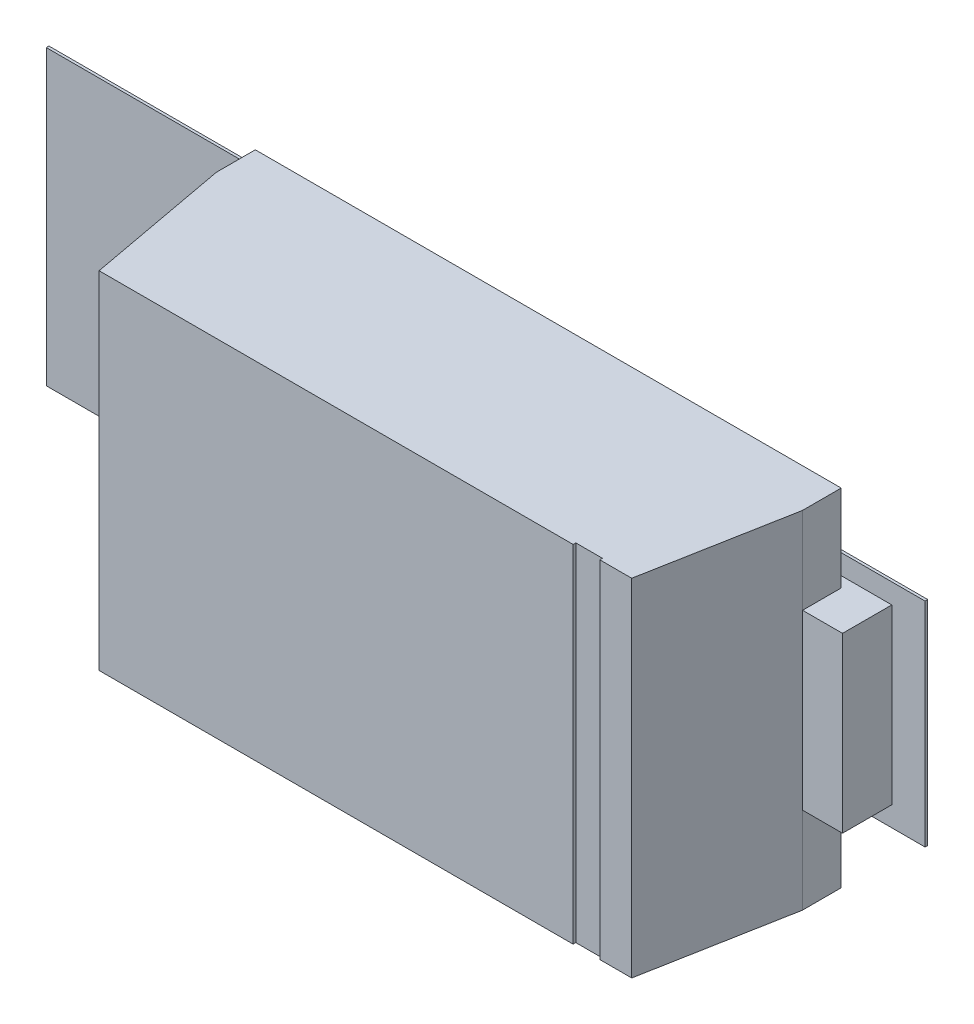
ISO-10303-21;
HEADER;
FILE_DESCRIPTION(('STEP AP214'),'2;1');
FILE_NAME('part.step','',(''),(''),'','','');
FILE_SCHEMA(('AUTOMOTIVE_DESIGN { 1 0 10303 214 1 1 1 1 }'));
ENDSEC;
DATA;
#1=APPLICATION_CONTEXT('core data for automotive mechanical design processes');
#2=APPLICATION_PROTOCOL_DEFINITION('international standard','automotive_design',2000,#1);
#3=PRODUCT_CONTEXT('',#1,'mechanical');
#4=PRODUCT('Part','Part','',(#3));
#5=PRODUCT_RELATED_PRODUCT_CATEGORY('part','',(#4));
#6=PRODUCT_DEFINITION_FORMATION('','',#4);
#7=PRODUCT_DEFINITION_CONTEXT('part definition',#1,'design');
#8=PRODUCT_DEFINITION('design','',#6,#7);
#9=PRODUCT_DEFINITION_SHAPE('','',#8);
#10=(LENGTH_UNIT() NAMED_UNIT(*) SI_UNIT(.MILLI.,.METRE.));
#11=(NAMED_UNIT(*) PLANE_ANGLE_UNIT() SI_UNIT($,.RADIAN.));
#12=(NAMED_UNIT(*) SI_UNIT($,.STERADIAN.) SOLID_ANGLE_UNIT());
#13=UNCERTAINTY_MEASURE_WITH_UNIT(LENGTH_MEASURE(1.E-05),#10,'distance_accuracy_value','');
#14=(GEOMETRIC_REPRESENTATION_CONTEXT(3) GLOBAL_UNCERTAINTY_ASSIGNED_CONTEXT((#13)) GLOBAL_UNIT_ASSIGNED_CONTEXT((#10,
#11,#12)) REPRESENTATION_CONTEXT('',''));
#15=CARTESIAN_POINT('',(0.,0.,0.));
#16=DIRECTION('',(0.,0.,1.));
#17=DIRECTION('',(1.,0.,0.));
#18=AXIS2_PLACEMENT_3D('',#15,#16,#17);
#19=CARTESIAN_POINT('',(-1.09999999999992,-0.64999999999994,0.272199999999978));
#20=DIRECTION('',(0.983318171348509,0.,-0.181893853375602));
#21=DIRECTION('',(0.,-1.,0.));
#22=AXIS2_PLACEMENT_3D('',#19,#20,#21);
#23=PLANE('',#22);
#24=DIRECTION('',(0.181893853375602,0.,0.983318171348509));
#25=VECTOR('',#24,1.);
#26=CARTESIAN_POINT('',(-1.09999999999992,0.64999999999994,0.272199999999978));
#27=LINE('',#26,#25);
#28=CARTESIAN_POINT('',(-1.09999999999992,0.64999999999994,0.272199999999978));
#29=VERTEX_POINT('',#28);
#30=CARTESIAN_POINT('',(-1.00000000000006,0.64999999999994,0.8128));
#31=VERTEX_POINT('',#30);
#32=EDGE_CURVE('E248',#29,#31,#27,.T.);
#33=ORIENTED_EDGE('',*,*,#32,.F.);
#34=DIRECTION('',(0.,-1.,0.));
#35=VECTOR('',#34,1.);
#36=CARTESIAN_POINT('',(-1.09999999999992,0.64999999999994,0.272199999999978));
#37=LINE('',#36,#35);
#38=CARTESIAN_POINT('',(-1.09999999999992,-0.64999999999994,0.272199999999978));
#39=VERTEX_POINT('',#38);
#40=EDGE_CURVE('E358',#29,#39,#37,.T.);
#41=ORIENTED_EDGE('',*,*,#40,.T.);
#42=DIRECTION('',(0.181893853375602,0.,0.983318171348509));
#43=VECTOR('',#42,1.);
#44=CARTESIAN_POINT('',(-1.09999999999992,-0.64999999999994,0.272199999999978));
#45=LINE('',#44,#43);
#46=CARTESIAN_POINT('',(-1.00000000000006,-0.64999999999994,0.8128));
#47=VERTEX_POINT('',#46);
#48=EDGE_CURVE('E290',#39,#47,#45,.T.);
#49=ORIENTED_EDGE('',*,*,#48,.T.);
#50=DIRECTION('',(0.,1.,0.));
#51=VECTOR('',#50,1.);
#52=CARTESIAN_POINT('',(-1.00000000000006,-0.64999999999994,0.8128));
#53=LINE('',#52,#51);
#54=EDGE_CURVE('E271',#47,#31,#53,.T.);
#55=ORIENTED_EDGE('',*,*,#54,.T.);
#56=EDGE_LOOP('',(#33,#41,#49,#55));
#57=FACE_BOUND('',#56,.T.);
#58=ADVANCED_FACE('F16',(#57),#23,.F.);
#59=CARTESIAN_POINT('',(1.25000000000008,-0.32499999999997,0.0762));
#60=DIRECTION('',(1.,0.,0.));
#61=DIRECTION('',(0.,1.,0.));
#62=AXIS2_PLACEMENT_3D('',#59,#60,#61);
#63=PLANE('',#62);
#64=DIRECTION('',(0.,1.,0.));
#65=VECTOR('',#64,1.);
#66=CARTESIAN_POINT('',(1.25000000000008,-0.32499999999997,0.0862000000000108));
#67=LINE('',#66,#65);
#68=CARTESIAN_POINT('',(1.25000000000008,-0.32499999999997,0.0862000000000108));
#69=VERTEX_POINT('',#68);
#70=CARTESIAN_POINT('',(1.25000000000008,0.32499999999997,0.0862000000000108));
#71=VERTEX_POINT('',#70);
#72=EDGE_CURVE('E313',#69,#71,#67,.T.);
#73=ORIENTED_EDGE('',*,*,#72,.T.);
#74=DIRECTION('',(0.,0.,1.));
#75=VECTOR('',#74,1.);
#76=CARTESIAN_POINT('',(1.25000000000008,0.32499999999997,0.0862000000000108));
#77=LINE('',#76,#75);
#78=CARTESIAN_POINT('',(1.25000000000008,0.32499999999997,0.271199999999982));
#79=VERTEX_POINT('',#78);
#80=EDGE_CURVE('E11',#71,#79,#77,.T.);
#81=ORIENTED_EDGE('',*,*,#80,.T.);
#82=DIRECTION('',(0.,1.,0.));
#83=VECTOR('',#82,1.);
#84=CARTESIAN_POINT('',(1.25000000000008,-0.32499999999997,0.271199999999982));
#85=LINE('',#84,#83);
#86=CARTESIAN_POINT('',(1.25000000000008,-0.32499999999997,0.271199999999982));
#87=VERTEX_POINT('',#86);
#88=EDGE_CURVE('E191',#87,#79,#85,.T.);
#89=ORIENTED_EDGE('',*,*,#88,.F.);
#90=DIRECTION('',(0.,0.,1.));
#91=VECTOR('',#90,1.);
#92=CARTESIAN_POINT('',(1.25000000000008,-0.32499999999997,0.0862000000000108));
#93=LINE('',#92,#91);
#94=EDGE_CURVE('E393',#69,#87,#93,.T.);
#95=ORIENTED_EDGE('',*,*,#94,.F.);
#96=EDGE_LOOP('',(#73,#81,#89,#95));
#97=FACE_BOUND('',#96,.T.);
#98=ADVANCED_FACE('F674',(#97),#63,.T.);
#99=CARTESIAN_POINT('',(1.25000000000008,0.32499999999997,0.0762));
#100=DIRECTION('',(0.,1.,0.));
#101=DIRECTION('',(1.,0.,0.));
#102=AXIS2_PLACEMENT_3D('',#99,#100,#101);
#103=PLANE('',#102);
#104=DIRECTION('',(-1.,0.,0.));
#105=VECTOR('',#104,1.);
#106=CARTESIAN_POINT('',(1.25000000000008,0.32499999999997,0.0862000000000108));
#107=LINE('',#106,#105);
#108=CARTESIAN_POINT('',(0.599999999999886,0.32499999999997,0.0862000000000108));
#109=VERTEX_POINT('',#108);
#110=EDGE_CURVE('E318',#71,#109,#107,.T.);
#111=ORIENTED_EDGE('',*,*,#110,.T.);
#112=DIRECTION('',(0.,0.,1.));
#113=VECTOR('',#112,1.);
#114=CARTESIAN_POINT('',(0.599999999999886,0.32499999999997,0.0862000000000108));
#115=LINE('',#114,#113);
#116=CARTESIAN_POINT('',(0.599999999999886,0.32499999999997,0.126200000000003));
#117=VERTEX_POINT('',#116);
#118=EDGE_CURVE('E27',#109,#117,#115,.T.);
#119=ORIENTED_EDGE('',*,*,#118,.T.);
#120=DIRECTION('',(-1.,0.,0.));
#121=VECTOR('',#120,1.);
#122=CARTESIAN_POINT('',(1.09999999999992,0.32499999999997,0.126200000000003));
#123=LINE('',#122,#121);
#124=CARTESIAN_POINT('',(1.09999999999992,0.32499999999997,0.126200000000003));
#125=VERTEX_POINT('',#124);
#126=EDGE_CURVE('E200',#125,#117,#123,.T.);
#127=ORIENTED_EDGE('',*,*,#126,.F.);
#128=DIRECTION('',(0.,0.,1.));
#129=VECTOR('',#128,1.);
#130=CARTESIAN_POINT('',(1.09999999999992,0.32499999999997,0.126200000000003));
#131=LINE('',#130,#129);
#132=CARTESIAN_POINT('',(1.09999999999992,0.32499999999997,0.271199999999982));
#133=VERTEX_POINT('',#132);
#134=EDGE_CURVE('E197',#125,#133,#131,.T.);
#135=ORIENTED_EDGE('',*,*,#134,.T.);
#136=DIRECTION('',(-1.,0.,0.));
#137=VECTOR('',#136,1.);
#138=CARTESIAN_POINT('',(1.25000000000008,0.32499999999997,0.271199999999982));
#139=LINE('',#138,#137);
#140=EDGE_CURVE('E183',#79,#133,#139,.T.);
#141=ORIENTED_EDGE('',*,*,#140,.F.);
#142=ORIENTED_EDGE('',*,*,#80,.F.);
#143=EDGE_LOOP('',(#111,#119,#127,#135,#141,#142));
#144=FACE_BOUND('',#143,.T.);
#145=ADVANCED_FACE('F198',(#144),#103,.T.);
#146=CARTESIAN_POINT('',(0.599999999999886,0.32499999999997,0.0762));
#147=DIRECTION('',(-1.,0.,0.));
#148=DIRECTION('',(0.,0.,1.));
#149=AXIS2_PLACEMENT_3D('',#146,#147,#148);
#150=PLANE('',#149);
#151=DIRECTION('',(0.,-1.,0.));
#152=VECTOR('',#151,1.);
#153=CARTESIAN_POINT('',(0.599999999999886,0.32499999999997,0.0862000000000108));
#154=LINE('',#153,#152);
#155=CARTESIAN_POINT('',(0.599999999999886,-0.32499999999997,0.0862000000000108));
#156=VERTEX_POINT('',#155);
#157=EDGE_CURVE('E229',#109,#156,#154,.T.);
#158=ORIENTED_EDGE('',*,*,#157,.T.);
#159=DIRECTION('',(0.,0.,1.));
#160=VECTOR('',#159,1.);
#161=CARTESIAN_POINT('',(0.599999999999886,-0.32499999999997,0.0862000000000108));
#162=LINE('',#161,#160);
#163=CARTESIAN_POINT('',(0.599999999999886,-0.32499999999997,0.126200000000003));
#164=VERTEX_POINT('',#163);
#165=EDGE_CURVE('E284',#156,#164,#162,.T.);
#166=ORIENTED_EDGE('',*,*,#165,.T.);
#167=DIRECTION('',(0.,-1.,0.));
#168=VECTOR('',#167,1.);
#169=CARTESIAN_POINT('',(0.599999999999886,0.32499999999997,0.126200000000003));
#170=LINE('',#169,#168);
#171=EDGE_CURVE('E283',#117,#164,#170,.T.);
#172=ORIENTED_EDGE('',*,*,#171,.F.);
#173=ORIENTED_EDGE('',*,*,#118,.F.);
#174=EDGE_LOOP('',(#158,#166,#172,#173));
#175=FACE_BOUND('',#174,.T.);
#176=ADVANCED_FACE('F686',(#175),#150,.T.);
#177=CARTESIAN_POINT('',(1.09999999999992,-0.64999999999994,0.126200000000003));
#178=DIRECTION('',(0.,0.,1.));
#179=DIRECTION('',(1.,0.,0.));
#180=AXIS2_PLACEMENT_3D('',#177,#178,#179);
#181=PLANE('',#180);
#182=DIRECTION('',(1.,0.,0.));
#183=VECTOR('',#182,1.);
#184=CARTESIAN_POINT('',(-1.09999999999992,-0.32499999999997,0.126200000000003));
#185=LINE('',#184,#183);
#186=CARTESIAN_POINT('',(-1.09999999999992,-0.32499999999997,0.126200000000003));
#187=VERTEX_POINT('',#186);
#188=CARTESIAN_POINT('',(0.0500000000000032,-0.32499999999997,0.126200000000003));
#189=VERTEX_POINT('',#188);
#190=EDGE_CURVE('E477',#187,#189,#185,.T.);
#191=ORIENTED_EDGE('',*,*,#190,.T.);
#192=DIRECTION('',(0.,1.,0.));
#193=VECTOR('',#192,1.);
#194=CARTESIAN_POINT('',(0.0500000000000032,-0.32499999999997,0.126200000000003));
#195=LINE('',#194,#193);
#196=CARTESIAN_POINT('',(0.0500000000000032,0.32499999999997,0.126200000000003));
#197=VERTEX_POINT('',#196);
#198=EDGE_CURVE('E354',#189,#197,#195,.T.);
#199=ORIENTED_EDGE('',*,*,#198,.T.);
#200=DIRECTION('',(1.,0.,0.));
#201=VECTOR('',#200,1.);
#202=CARTESIAN_POINT('',(-1.09999999999992,0.32499999999997,0.126200000000003));
#203=LINE('',#202,#201);
#204=CARTESIAN_POINT('',(-1.09999999999992,0.32499999999997,0.126200000000003));
#205=VERTEX_POINT('',#204);
#206=EDGE_CURVE('E221',#205,#197,#203,.T.);
#207=ORIENTED_EDGE('',*,*,#206,.F.);
#208=DIRECTION('',(0.,-1.,0.));
#209=VECTOR('',#208,1.);
#210=CARTESIAN_POINT('',(-1.09999999999992,0.64999999999994,0.126200000000003));
#211=LINE('',#210,#209);
#212=CARTESIAN_POINT('',(-1.09999999999992,0.64999999999994,0.126200000000003));
#213=VERTEX_POINT('',#212);
#214=EDGE_CURVE('E435',#213,#205,#211,.T.);
#215=ORIENTED_EDGE('',*,*,#214,.F.);
#216=DIRECTION('',(-1.,0.,0.));
#217=VECTOR('',#216,1.);
#218=CARTESIAN_POINT('',(1.09999999999992,0.64999999999994,0.126200000000003));
#219=LINE('',#218,#217);
#220=CARTESIAN_POINT('',(1.09999999999992,0.64999999999994,0.126200000000003));
#221=VERTEX_POINT('',#220);
#222=EDGE_CURVE('E322',#221,#213,#219,.T.);
#223=ORIENTED_EDGE('',*,*,#222,.F.);
#224=DIRECTION('',(0.,1.,0.));
#225=VECTOR('',#224,1.);
#226=CARTESIAN_POINT('',(1.09999999999992,0.32499999999997,0.126200000000003));
#227=LINE('',#226,#225);
#228=EDGE_CURVE('E205',#125,#221,#227,.T.);
#229=ORIENTED_EDGE('',*,*,#228,.F.);
#230=ORIENTED_EDGE('',*,*,#126,.T.);
#231=ORIENTED_EDGE('',*,*,#171,.T.);
#232=DIRECTION('',(-1.,0.,0.));
#233=VECTOR('',#232,1.);
#234=CARTESIAN_POINT('',(1.09999999999992,-0.32499999999997,0.126200000000003));
#235=LINE('',#234,#233);
#236=CARTESIAN_POINT('',(1.09999999999992,-0.32499999999997,0.126200000000003));
#237=VERTEX_POINT('',#236);
#238=EDGE_CURVE('E289',#237,#164,#235,.T.);
#239=ORIENTED_EDGE('',*,*,#238,.F.);
#240=DIRECTION('',(0.,1.,0.));
#241=VECTOR('',#240,1.);
#242=CARTESIAN_POINT('',(1.09999999999992,-0.64999999999994,0.126200000000003));
#243=LINE('',#242,#241);
#244=CARTESIAN_POINT('',(1.09999999999992,-0.64999999999994,0.126200000000003));
#245=VERTEX_POINT('',#244);
#246=EDGE_CURVE('E224',#245,#237,#243,.T.);
#247=ORIENTED_EDGE('',*,*,#246,.F.);
#248=DIRECTION('',(1.,0.,0.));
#249=VECTOR('',#248,1.);
#250=CARTESIAN_POINT('',(-1.09999999999992,-0.64999999999994,0.126200000000003));
#251=LINE('',#250,#249);
#252=CARTESIAN_POINT('',(-1.09999999999992,-0.64999999999994,0.126200000000003));
#253=VERTEX_POINT('',#252);
#254=EDGE_CURVE('E308',#253,#245,#251,.T.);
#255=ORIENTED_EDGE('',*,*,#254,.F.);
#256=DIRECTION('',(0.,-1.,0.));
#257=VECTOR('',#256,1.);
#258=CARTESIAN_POINT('',(-1.09999999999992,-0.32499999999997,0.126200000000003));
#259=LINE('',#258,#257);
#260=EDGE_CURVE('E194',#187,#253,#259,.T.);
#261=ORIENTED_EDGE('',*,*,#260,.F.);
#262=EDGE_LOOP('',(#191,#199,#207,#215,#223,#229,#230,#231,#239,#247,#255,#261));
#263=FACE_BOUND('',#262,.T.);
#264=ADVANCED_FACE('F501',(#263),#181,.F.);
#265=CARTESIAN_POINT('',(-1.09999999999992,0.64999999999994,0.0762));
#266=DIRECTION('',(-1.,0.,0.));
#267=DIRECTION('',(0.,0.,1.));
#268=AXIS2_PLACEMENT_3D('',#265,#266,#267);
#269=PLANE('',#268);
#270=DIRECTION('',(0.,0.,1.));
#271=VECTOR('',#270,1.);
#272=CARTESIAN_POINT('',(-1.09999999999992,-0.32499999999997,0.126200000000003));
#273=LINE('',#272,#271);
#274=CARTESIAN_POINT('',(-1.09999999999992,-0.32499999999997,0.271199999999982));
#275=VERTEX_POINT('',#274);
#276=EDGE_CURVE('E473',#187,#275,#273,.T.);
#277=ORIENTED_EDGE('',*,*,#276,.F.);
#278=ORIENTED_EDGE('',*,*,#260,.T.);
#279=DIRECTION('',(0.,0.,1.));
#280=VECTOR('',#279,1.);
#281=CARTESIAN_POINT('',(-1.09999999999992,-0.64999999999994,0.126200000000003));
#282=LINE('',#281,#280);
#283=EDGE_CURVE('E294',#253,#39,#282,.T.);
#284=ORIENTED_EDGE('',*,*,#283,.T.);
#285=ORIENTED_EDGE('',*,*,#40,.F.);
#286=DIRECTION('',(0.,0.,1.));
#287=VECTOR('',#286,1.);
#288=CARTESIAN_POINT('',(-1.09999999999992,0.64999999999994,0.126200000000003));
#289=LINE('',#288,#287);
#290=EDGE_CURVE('E274',#213,#29,#289,.T.);
#291=ORIENTED_EDGE('',*,*,#290,.F.);
#292=ORIENTED_EDGE('',*,*,#214,.T.);
#293=DIRECTION('',(0.,0.,1.));
#294=VECTOR('',#293,1.);
#295=CARTESIAN_POINT('',(-1.09999999999992,0.32499999999997,0.126200000000003));
#296=LINE('',#295,#294);
#297=CARTESIAN_POINT('',(-1.09999999999992,0.32499999999997,0.271199999999982));
#298=VERTEX_POINT('',#297);
#299=EDGE_CURVE('E427',#205,#298,#296,.T.);
#300=ORIENTED_EDGE('',*,*,#299,.T.);
#301=DIRECTION('',(0.,1.,0.));
#302=VECTOR('',#301,1.);
#303=CARTESIAN_POINT('',(-1.09999999999992,-0.32499999999997,0.271199999999982));
#304=LINE('',#303,#302);
#305=EDGE_CURVE('E481',#275,#298,#304,.T.);
#306=ORIENTED_EDGE('',*,*,#305,.F.);
#307=EDGE_LOOP('',(#277,#278,#284,#285,#291,#292,#300,#306));
#308=FACE_BOUND('',#307,.T.);
#309=ADVANCED_FACE('F491',(#308),#269,.T.);
#310=CARTESIAN_POINT('',(0.,0.,0.271199999999982));
#311=DIRECTION('',(0.,0.,1.));
#312=DIRECTION('',(1.,0.,0.));
#313=AXIS2_PLACEMENT_3D('',#310,#311,#312);
#314=PLANE('',#313);
#315=DIRECTION('',(1.,0.,0.));
#316=VECTOR('',#315,1.);
#317=CARTESIAN_POINT('',(1.09999999999992,-0.32499999999997,0.271199999999982));
#318=LINE('',#317,#316);
#319=CARTESIAN_POINT('',(1.09999999999992,-0.32499999999997,0.271199999999982));
#320=VERTEX_POINT('',#319);
#321=EDGE_CURVE('E387',#320,#87,#318,.T.);
#322=ORIENTED_EDGE('',*,*,#321,.T.);
#323=ORIENTED_EDGE('',*,*,#88,.T.);
#324=ORIENTED_EDGE('',*,*,#140,.T.);
#325=DIRECTION('',(0.,1.,0.));
#326=VECTOR('',#325,1.);
#327=CARTESIAN_POINT('',(1.09999999999992,-0.32499999999997,0.271199999999982));
#328=LINE('',#327,#326);
#329=EDGE_CURVE('E188',#320,#133,#328,.T.);
#330=ORIENTED_EDGE('',*,*,#329,.F.);
#331=EDGE_LOOP('',(#322,#323,#324,#330));
#332=FACE_BOUND('',#331,.T.);
#333=ADVANCED_FACE('F186',(#332),#314,.T.);
#334=CARTESIAN_POINT('',(0.,0.,0.271199999999982));
#335=DIRECTION('',(0.,0.,1.));
#336=DIRECTION('',(1.,0.,0.));
#337=AXIS2_PLACEMENT_3D('',#334,#335,#336);
#338=PLANE('',#337);
#339=DIRECTION('',(1.,0.,0.));
#340=VECTOR('',#339,1.);
#341=CARTESIAN_POINT('',(-1.25000000000008,-0.32499999999997,0.271199999999982));
#342=LINE('',#341,#340);
#343=CARTESIAN_POINT('',(-1.25000000000008,-0.32499999999997,0.271199999999982));
#344=VERTEX_POINT('',#343);
#345=EDGE_CURVE('E476',#344,#275,#342,.T.);
#346=ORIENTED_EDGE('',*,*,#345,.T.);
#347=ORIENTED_EDGE('',*,*,#305,.T.);
#348=DIRECTION('',(-1.,0.,0.));
#349=VECTOR('',#348,1.);
#350=CARTESIAN_POINT('',(-1.09999999999992,0.32499999999997,0.271199999999982));
#351=LINE('',#350,#349);
#352=CARTESIAN_POINT('',(-1.25000000000008,0.32499999999997,0.271199999999982));
#353=VERTEX_POINT('',#352);
#354=EDGE_CURVE('E346',#298,#353,#351,.T.);
#355=ORIENTED_EDGE('',*,*,#354,.T.);
#356=DIRECTION('',(0.,-1.,0.));
#357=VECTOR('',#356,1.);
#358=CARTESIAN_POINT('',(-1.25000000000008,0.32499999999997,0.271199999999982));
#359=LINE('',#358,#357);
#360=EDGE_CURVE('E337',#353,#344,#359,.T.);
#361=ORIENTED_EDGE('',*,*,#360,.T.);
#362=EDGE_LOOP('',(#346,#347,#355,#361));
#363=FACE_BOUND('',#362,.T.);
#364=ADVANCED_FACE('F719',(#363),#338,.T.);
#365=CARTESIAN_POINT('',(-1.25000000000008,-0.32499999999997,0.0762));
#366=DIRECTION('',(0.,-1.,0.));
#367=DIRECTION('',(0.,0.,-1.));
#368=AXIS2_PLACEMENT_3D('',#365,#366,#367);
#369=PLANE('',#368);
#370=DIRECTION('',(1.,0.,0.));
#371=VECTOR('',#370,1.);
#372=CARTESIAN_POINT('',(-1.25000000000008,-0.32499999999997,0.0862000000000108));
#373=LINE('',#372,#371);
#374=CARTESIAN_POINT('',(-1.25000000000008,-0.32499999999997,0.0862000000000108));
#375=VERTEX_POINT('',#374);
#376=CARTESIAN_POINT('',(0.0500000000000032,-0.32499999999997,0.0862000000000108));
#377=VERTEX_POINT('',#376);
#378=EDGE_CURVE('E267',#375,#377,#373,.T.);
#379=ORIENTED_EDGE('',*,*,#378,.T.);
#380=DIRECTION('',(0.,0.,1.));
#381=VECTOR('',#380,1.);
#382=CARTESIAN_POINT('',(0.0500000000000032,-0.32499999999997,0.0862000000000108));
#383=LINE('',#382,#381);
#384=EDGE_CURVE('E534',#377,#189,#383,.T.);
#385=ORIENTED_EDGE('',*,*,#384,.T.);
#386=ORIENTED_EDGE('',*,*,#190,.F.);
#387=ORIENTED_EDGE('',*,*,#276,.T.);
#388=ORIENTED_EDGE('',*,*,#345,.F.);
#389=DIRECTION('',(0.,0.,1.));
#390=VECTOR('',#389,1.);
#391=CARTESIAN_POINT('',(-1.25000000000008,-0.32499999999997,0.0862000000000108));
#392=LINE('',#391,#390);
#393=EDGE_CURVE('E342',#375,#344,#392,.T.);
#394=ORIENTED_EDGE('',*,*,#393,.F.);
#395=EDGE_LOOP('',(#379,#385,#386,#387,#388,#394));
#396=FACE_BOUND('',#395,.T.);
#397=ADVANCED_FACE('F715',(#396),#369,.T.);
#398=CARTESIAN_POINT('',(0.0500000000000032,-0.32499999999997,0.0762));
#399=DIRECTION('',(1.,0.,0.));
#400=DIRECTION('',(0.,1.,0.));
#401=AXIS2_PLACEMENT_3D('',#398,#399,#400);
#402=PLANE('',#401);
#403=DIRECTION('',(0.,1.,0.));
#404=VECTOR('',#403,1.);
#405=CARTESIAN_POINT('',(0.0500000000000032,-0.32499999999997,0.0862000000000108));
#406=LINE('',#405,#404);
#407=CARTESIAN_POINT('',(0.0500000000000032,0.32499999999997,0.0862000000000108));
#408=VERTEX_POINT('',#407);
#409=EDGE_CURVE('E398',#377,#408,#406,.T.);
#410=ORIENTED_EDGE('',*,*,#409,.T.);
#411=DIRECTION('',(0.,0.,1.));
#412=VECTOR('',#411,1.);
#413=CARTESIAN_POINT('',(0.0500000000000032,0.32499999999997,0.0862000000000108));
#414=LINE('',#413,#412);
#415=EDGE_CURVE('E350',#408,#197,#414,.T.);
#416=ORIENTED_EDGE('',*,*,#415,.T.);
#417=ORIENTED_EDGE('',*,*,#198,.F.);
#418=ORIENTED_EDGE('',*,*,#384,.F.);
#419=EDGE_LOOP('',(#410,#416,#417,#418));
#420=FACE_BOUND('',#419,.T.);
#421=ADVANCED_FACE('F718',(#420),#402,.T.);
#422=CARTESIAN_POINT('',(0.0500000000000032,0.32499999999997,0.0762));
#423=DIRECTION('',(0.,1.,0.));
#424=DIRECTION('',(1.,0.,0.));
#425=AXIS2_PLACEMENT_3D('',#422,#423,#424);
#426=PLANE('',#425);
#427=DIRECTION('',(-1.,0.,0.));
#428=VECTOR('',#427,1.);
#429=CARTESIAN_POINT('',(0.0500000000000032,0.32499999999997,0.0862000000000108));
#430=LINE('',#429,#428);
#431=CARTESIAN_POINT('',(-1.25000000000008,0.32499999999997,0.0862000000000108));
#432=VERTEX_POINT('',#431);
#433=EDGE_CURVE('E402',#408,#432,#430,.T.);
#434=ORIENTED_EDGE('',*,*,#433,.T.);
#435=DIRECTION('',(0.,0.,1.));
#436=VECTOR('',#435,1.);
#437=CARTESIAN_POINT('',(-1.25000000000008,0.32499999999997,0.0862000000000108));
#438=LINE('',#437,#436);
#439=EDGE_CURVE('E341',#432,#353,#438,.T.);
#440=ORIENTED_EDGE('',*,*,#439,.T.);
#441=ORIENTED_EDGE('',*,*,#354,.F.);
#442=ORIENTED_EDGE('',*,*,#299,.F.);
#443=ORIENTED_EDGE('',*,*,#206,.T.);
#444=ORIENTED_EDGE('',*,*,#415,.F.);
#445=EDGE_LOOP('',(#434,#440,#441,#442,#443,#444));
#446=FACE_BOUND('',#445,.T.);
#447=ADVANCED_FACE('F506',(#446),#426,.T.);
#448=CARTESIAN_POINT('',(-1.25000000000008,0.32499999999997,0.0762));
#449=DIRECTION('',(-1.,0.,0.));
#450=DIRECTION('',(0.,0.,1.));
#451=AXIS2_PLACEMENT_3D('',#448,#449,#450);
#452=PLANE('',#451);
#453=DIRECTION('',(0.,-1.,0.));
#454=VECTOR('',#453,1.);
#455=CARTESIAN_POINT('',(-1.25000000000008,0.32499999999997,0.0862000000000108));
#456=LINE('',#455,#454);
#457=EDGE_CURVE('E419',#432,#375,#456,.T.);
#458=ORIENTED_EDGE('',*,*,#457,.T.);
#459=ORIENTED_EDGE('',*,*,#393,.T.);
#460=ORIENTED_EDGE('',*,*,#360,.F.);
#461=ORIENTED_EDGE('',*,*,#439,.F.);
#462=EDGE_LOOP('',(#458,#459,#460,#461));
#463=FACE_BOUND('',#462,.T.);
#464=ADVANCED_FACE('F712',(#463),#452,.T.);
#465=CARTESIAN_POINT('',(1.37500000000009,0.399999999999924,0.0762));
#466=DIRECTION('',(0.,1.,0.));
#467=DIRECTION('',(1.,0.,0.));
#468=AXIS2_PLACEMENT_3D('',#465,#466,#467);
#469=PLANE('',#468);
#470=DIRECTION('',(-1.,0.,0.));
#471=VECTOR('',#470,1.);
#472=CARTESIAN_POINT('',(1.37500000000009,0.399999999999924,0.0762));
#473=LINE('',#472,#471);
#474=CARTESIAN_POINT('',(1.37500000000009,0.399999999999924,0.0762));
#475=VERTEX_POINT('',#474);
#476=CARTESIAN_POINT('',(0.574999999999986,0.399999999999924,0.0762));
#477=VERTEX_POINT('',#476);
#478=EDGE_CURVE('E376',#475,#477,#473,.T.);
#479=ORIENTED_EDGE('',*,*,#478,.T.);
#480=DIRECTION('',(0.,0.,1.));
#481=VECTOR('',#480,1.);
#482=CARTESIAN_POINT('',(0.574999999999986,0.399999999999924,0.0762));
#483=LINE('',#482,#481);
#484=CARTESIAN_POINT('',(0.574999999999986,0.399999999999924,0.0862000000000108));
#485=VERTEX_POINT('',#484);
#486=EDGE_CURVE('E236',#477,#485,#483,.T.);
#487=ORIENTED_EDGE('',*,*,#486,.T.);
#488=DIRECTION('',(-1.,0.,0.));
#489=VECTOR('',#488,1.);
#490=CARTESIAN_POINT('',(1.37500000000009,0.399999999999924,0.0862000000000108));
#491=LINE('',#490,#489);
#492=CARTESIAN_POINT('',(1.37500000000009,0.399999999999924,0.0862000000000108));
#493=VERTEX_POINT('',#492);
#494=EDGE_CURVE('E225',#493,#485,#491,.T.);
#495=ORIENTED_EDGE('',*,*,#494,.F.);
#496=DIRECTION('',(0.,0.,1.));
#497=VECTOR('',#496,1.);
#498=CARTESIAN_POINT('',(1.37500000000009,0.399999999999924,0.0762));
#499=LINE('',#498,#497);
#500=EDGE_CURVE('E333',#475,#493,#499,.T.);
#501=ORIENTED_EDGE('',*,*,#500,.F.);
#502=EDGE_LOOP('',(#479,#487,#495,#501));
#503=FACE_BOUND('',#502,.T.);
#504=ADVANCED_FACE('F566',(#503),#469,.T.);
#505=CARTESIAN_POINT('',(1.37500000000009,-0.399999999999924,0.0762));
#506=DIRECTION('',(1.,0.,0.));
#507=DIRECTION('',(0.,1.,0.));
#508=AXIS2_PLACEMENT_3D('',#505,#506,#507);
#509=PLANE('',#508);
#510=DIRECTION('',(0.,1.,0.));
#511=VECTOR('',#510,1.);
#512=CARTESIAN_POINT('',(1.37500000000009,-0.399999999999924,0.0762));
#513=LINE('',#512,#511);
#514=CARTESIAN_POINT('',(1.37500000000009,-0.399999999999924,0.0762));
#515=VERTEX_POINT('',#514);
#516=EDGE_CURVE('E379',#515,#475,#513,.T.);
#517=ORIENTED_EDGE('',*,*,#516,.T.);
#518=ORIENTED_EDGE('',*,*,#500,.T.);
#519=DIRECTION('',(0.,1.,0.));
#520=VECTOR('',#519,1.);
#521=CARTESIAN_POINT('',(1.37500000000009,-0.399999999999924,0.0862000000000108));
#522=LINE('',#521,#520);
#523=CARTESIAN_POINT('',(1.37500000000009,-0.399999999999924,0.0862000000000108));
#524=VERTEX_POINT('',#523);
#525=EDGE_CURVE('E230',#524,#493,#522,.T.);
#526=ORIENTED_EDGE('',*,*,#525,.F.);
#527=DIRECTION('',(0.,0.,1.));
#528=VECTOR('',#527,1.);
#529=CARTESIAN_POINT('',(1.37500000000009,-0.399999999999924,0.0762));
#530=LINE('',#529,#528);
#531=EDGE_CURVE('E298',#515,#524,#530,.T.);
#532=ORIENTED_EDGE('',*,*,#531,.F.);
#533=EDGE_LOOP('',(#517,#518,#526,#532));
#534=FACE_BOUND('',#533,.T.);
#535=ADVANCED_FACE('F711',(#534),#509,.T.);
#536=CARTESIAN_POINT('',(0.574999999999986,-0.399999999999924,0.0762));
#537=DIRECTION('',(0.,-1.,0.));
#538=DIRECTION('',(0.,0.,-1.));
#539=AXIS2_PLACEMENT_3D('',#536,#537,#538);
#540=PLANE('',#539);
#541=DIRECTION('',(1.,0.,0.));
#542=VECTOR('',#541,1.);
#543=CARTESIAN_POINT('',(0.574999999999986,-0.399999999999924,0.0762));
#544=LINE('',#543,#542);
#545=CARTESIAN_POINT('',(0.574999999999986,-0.399999999999924,0.0762));
#546=VERTEX_POINT('',#545);
#547=EDGE_CURVE('E348',#546,#515,#544,.T.);
#548=ORIENTED_EDGE('',*,*,#547,.T.);
#549=ORIENTED_EDGE('',*,*,#531,.T.);
#550=DIRECTION('',(1.,0.,0.));
#551=VECTOR('',#550,1.);
#552=CARTESIAN_POINT('',(0.574999999999986,-0.399999999999924,0.0862000000000108));
#553=LINE('',#552,#551);
#554=CARTESIAN_POINT('',(0.574999999999986,-0.399999999999924,0.0862000000000108));
#555=VERTEX_POINT('',#554);
#556=EDGE_CURVE('E359',#555,#524,#553,.T.);
#557=ORIENTED_EDGE('',*,*,#556,.F.);
#558=DIRECTION('',(0.,0.,1.));
#559=VECTOR('',#558,1.);
#560=CARTESIAN_POINT('',(0.574999999999986,-0.399999999999924,0.0762));
#561=LINE('',#560,#559);
#562=EDGE_CURVE('E266',#546,#555,#561,.T.);
#563=ORIENTED_EDGE('',*,*,#562,.F.);
#564=EDGE_LOOP('',(#548,#549,#557,#563));
#565=FACE_BOUND('',#564,.T.);
#566=ADVANCED_FACE('F562',(#565),#540,.T.);
#567=CARTESIAN_POINT('',(-1.92499999999992,0.550000000000086,0.0762));
#568=DIRECTION('',(-1.,0.,0.));
#569=DIRECTION('',(0.,0.,1.));
#570=AXIS2_PLACEMENT_3D('',#567,#568,#569);
#571=PLANE('',#570);
#572=DIRECTION('',(0.,-1.,0.));
#573=VECTOR('',#572,1.);
#574=CARTESIAN_POINT('',(-1.92499999999992,0.550000000000086,0.0762));
#575=LINE('',#574,#573);
#576=CARTESIAN_POINT('',(-1.92499999999992,0.550000000000086,0.0762));
#577=VERTEX_POINT('',#576);
#578=CARTESIAN_POINT('',(-1.92499999999992,-0.550000000000086,0.0762));
#579=VERTEX_POINT('',#578);
#580=EDGE_CURVE('E380',#577,#579,#575,.T.);
#581=ORIENTED_EDGE('',*,*,#580,.T.);
#582=DIRECTION('',(0.,0.,1.));
#583=VECTOR('',#582,1.);
#584=CARTESIAN_POINT('',(-1.92499999999992,-0.550000000000086,0.0762));
#585=LINE('',#584,#583);
#586=CARTESIAN_POINT('',(-1.92499999999992,-0.550000000000086,0.0862000000000108));
#587=VERTEX_POINT('',#586);
#588=EDGE_CURVE('E295',#579,#587,#585,.T.);
#589=ORIENTED_EDGE('',*,*,#588,.T.);
#590=DIRECTION('',(0.,-1.,0.));
#591=VECTOR('',#590,1.);
#592=CARTESIAN_POINT('',(-1.92499999999992,0.550000000000086,0.0862000000000108));
#593=LINE('',#592,#591);
#594=CARTESIAN_POINT('',(-1.92499999999992,0.550000000000086,0.0862000000000108));
#595=VERTEX_POINT('',#594);
#596=EDGE_CURVE('E397',#595,#587,#593,.T.);
#597=ORIENTED_EDGE('',*,*,#596,.F.);
#598=DIRECTION('',(0.,0.,1.));
#599=VECTOR('',#598,1.);
#600=CARTESIAN_POINT('',(-1.92499999999992,0.550000000000086,0.0762));
#601=LINE('',#600,#599);
#602=EDGE_CURVE('E330',#577,#595,#601,.T.);
#603=ORIENTED_EDGE('',*,*,#602,.F.);
#604=EDGE_LOOP('',(#581,#589,#597,#603));
#605=FACE_BOUND('',#604,.T.);
#606=ADVANCED_FACE('F646',(#605),#571,.T.);
#607=CARTESIAN_POINT('',(-1.92499999999992,-0.550000000000086,0.0762));
#608=DIRECTION('',(0.,-1.,0.));
#609=DIRECTION('',(0.,0.,-1.));
#610=AXIS2_PLACEMENT_3D('',#607,#608,#609);
#611=PLANE('',#610);
#612=DIRECTION('',(1.,0.,0.));
#613=VECTOR('',#612,1.);
#614=CARTESIAN_POINT('',(-1.92499999999992,-0.550000000000086,0.0762));
#615=LINE('',#614,#613);
#616=CARTESIAN_POINT('',(0.0750000000000048,-0.550000000000086,0.0762));
#617=VERTEX_POINT('',#616);
#618=EDGE_CURVE('E369',#579,#617,#615,.T.);
#619=ORIENTED_EDGE('',*,*,#618,.T.);
#620=DIRECTION('',(0.,0.,1.));
#621=VECTOR('',#620,1.);
#622=CARTESIAN_POINT('',(0.0750000000000048,-0.550000000000086,0.0762));
#623=LINE('',#622,#621);
#624=CARTESIAN_POINT('',(0.0750000000000048,-0.550000000000086,0.0862000000000108));
#625=VERTEX_POINT('',#624);
#626=EDGE_CURVE('E299',#617,#625,#623,.T.);
#627=ORIENTED_EDGE('',*,*,#626,.T.);
#628=DIRECTION('',(1.,0.,0.));
#629=VECTOR('',#628,1.);
#630=CARTESIAN_POINT('',(-1.92499999999992,-0.550000000000086,0.0862000000000108));
#631=LINE('',#630,#629);
#632=EDGE_CURVE('E442',#587,#625,#631,.T.);
#633=ORIENTED_EDGE('',*,*,#632,.F.);
#634=ORIENTED_EDGE('',*,*,#588,.F.);
#635=EDGE_LOOP('',(#619,#627,#633,#634));
#636=FACE_BOUND('',#635,.T.);
#637=ADVANCED_FACE('F18',(#636),#611,.T.);
#638=CARTESIAN_POINT('',(0.0750000000000048,-0.550000000000086,0.0762));
#639=DIRECTION('',(1.,0.,0.));
#640=DIRECTION('',(0.,1.,0.));
#641=AXIS2_PLACEMENT_3D('',#638,#639,#640);
#642=PLANE('',#641);
#643=DIRECTION('',(0.,1.,0.));
#644=VECTOR('',#643,1.);
#645=CARTESIAN_POINT('',(0.0750000000000048,-0.550000000000086,0.0762));
#646=LINE('',#645,#644);
#647=CARTESIAN_POINT('',(0.0750000000000048,0.550000000000086,0.0762));
#648=VERTEX_POINT('',#647);
#649=EDGE_CURVE('E235',#617,#648,#646,.T.);
#650=ORIENTED_EDGE('',*,*,#649,.T.);
#651=DIRECTION('',(0.,0.,1.));
#652=VECTOR('',#651,1.);
#653=CARTESIAN_POINT('',(0.0750000000000048,0.550000000000086,0.0762));
#654=LINE('',#653,#652);
#655=CARTESIAN_POINT('',(0.0750000000000048,0.550000000000086,0.0862000000000108));
#656=VERTEX_POINT('',#655);
#657=EDGE_CURVE('E327',#648,#656,#654,.T.);
#658=ORIENTED_EDGE('',*,*,#657,.T.);
#659=DIRECTION('',(0.,1.,0.));
#660=VECTOR('',#659,1.);
#661=CARTESIAN_POINT('',(0.0750000000000048,-0.550000000000086,0.0862000000000108));
#662=LINE('',#661,#660);
#663=EDGE_CURVE('E423',#625,#656,#662,.T.);
#664=ORIENTED_EDGE('',*,*,#663,.F.);
#665=ORIENTED_EDGE('',*,*,#626,.F.);
#666=EDGE_LOOP('',(#650,#658,#664,#665));
#667=FACE_BOUND('',#666,.T.);
#668=ADVANCED_FACE('F651',(#667),#642,.T.);
#669=CARTESIAN_POINT('',(0.0750000000000048,0.550000000000086,0.0762));
#670=DIRECTION('',(0.,1.,0.));
#671=DIRECTION('',(1.,0.,0.));
#672=AXIS2_PLACEMENT_3D('',#669,#670,#671);
#673=PLANE('',#672);
#674=DIRECTION('',(-1.,0.,0.));
#675=VECTOR('',#674,1.);
#676=CARTESIAN_POINT('',(0.0750000000000048,0.550000000000086,0.0762));
#677=LINE('',#676,#675);
#678=EDGE_CURVE('E231',#648,#577,#677,.T.);
#679=ORIENTED_EDGE('',*,*,#678,.T.);
#680=ORIENTED_EDGE('',*,*,#602,.T.);
#681=DIRECTION('',(-1.,0.,0.));
#682=VECTOR('',#681,1.);
#683=CARTESIAN_POINT('',(0.0750000000000048,0.550000000000086,0.0862000000000108));
#684=LINE('',#683,#682);
#685=EDGE_CURVE('E317',#656,#595,#684,.T.);
#686=ORIENTED_EDGE('',*,*,#685,.F.);
#687=ORIENTED_EDGE('',*,*,#657,.F.);
#688=EDGE_LOOP('',(#679,#680,#686,#687));
#689=FACE_BOUND('',#688,.T.);
#690=ADVANCED_FACE('F659',(#689),#673,.T.);
#691=CARTESIAN_POINT('',(0.,0.,0.0762));
#692=DIRECTION('',(0.,0.,1.));
#693=DIRECTION('',(1.,0.,0.));
#694=AXIS2_PLACEMENT_3D('',#691,#692,#693);
#695=PLANE('',#694);
#696=DIRECTION('',(0.,-1.,0.));
#697=VECTOR('',#696,1.);
#698=CARTESIAN_POINT('',(0.574999999999986,0.399999999999924,0.0762));
#699=LINE('',#698,#697);
#700=EDGE_CURVE('E262',#477,#546,#699,.T.);
#701=ORIENTED_EDGE('',*,*,#700,.F.);
#702=ORIENTED_EDGE('',*,*,#478,.F.);
#703=ORIENTED_EDGE('',*,*,#516,.F.);
#704=ORIENTED_EDGE('',*,*,#547,.F.);
#705=EDGE_LOOP('',(#701,#702,#703,#704));
#706=FACE_BOUND('',#705,.T.);
#707=ADVANCED_FACE('F661',(#706),#695,.F.);
#708=CARTESIAN_POINT('',(0.,0.,0.0762));
#709=DIRECTION('',(0.,0.,1.));
#710=DIRECTION('',(1.,0.,0.));
#711=AXIS2_PLACEMENT_3D('',#708,#709,#710);
#712=PLANE('',#711);
#713=ORIENTED_EDGE('',*,*,#678,.F.);
#714=ORIENTED_EDGE('',*,*,#649,.F.);
#715=ORIENTED_EDGE('',*,*,#618,.F.);
#716=ORIENTED_EDGE('',*,*,#580,.F.);
#717=EDGE_LOOP('',(#713,#714,#715,#716));
#718=FACE_BOUND('',#717,.T.);
#719=ADVANCED_FACE('F649',(#718),#712,.F.);
#720=CARTESIAN_POINT('',(0.574999999999986,0.399999999999924,0.0762));
#721=DIRECTION('',(-1.,0.,0.));
#722=DIRECTION('',(0.,0.,1.));
#723=AXIS2_PLACEMENT_3D('',#720,#721,#722);
#724=PLANE('',#723);
#725=ORIENTED_EDGE('',*,*,#700,.T.);
#726=ORIENTED_EDGE('',*,*,#562,.T.);
#727=DIRECTION('',(0.,-1.,0.));
#728=VECTOR('',#727,1.);
#729=CARTESIAN_POINT('',(0.574999999999986,0.399999999999924,0.0862000000000108));
#730=LINE('',#729,#728);
#731=EDGE_CURVE('E288',#485,#555,#730,.T.);
#732=ORIENTED_EDGE('',*,*,#731,.F.);
#733=ORIENTED_EDGE('',*,*,#486,.F.);
#734=EDGE_LOOP('',(#725,#726,#732,#733));
#735=FACE_BOUND('',#734,.T.);
#736=ADVANCED_FACE('F556',(#735),#724,.T.);
#737=CARTESIAN_POINT('',(0.,0.,0.0862000000000108));
#738=DIRECTION('',(0.,0.,1.));
#739=DIRECTION('',(1.,0.,0.));
#740=AXIS2_PLACEMENT_3D('',#737,#738,#739);
#741=PLANE('',#740);
#742=ORIENTED_EDGE('',*,*,#457,.F.);
#743=ORIENTED_EDGE('',*,*,#433,.F.);
#744=ORIENTED_EDGE('',*,*,#409,.F.);
#745=ORIENTED_EDGE('',*,*,#378,.F.);
#746=EDGE_LOOP('',(#742,#743,#744,#745));
#747=FACE_BOUND('',#746,.T.);
#748=ORIENTED_EDGE('',*,*,#685,.T.);
#749=ORIENTED_EDGE('',*,*,#596,.T.);
#750=ORIENTED_EDGE('',*,*,#632,.T.);
#751=ORIENTED_EDGE('',*,*,#663,.T.);
#752=EDGE_LOOP('',(#748,#749,#750,#751));
#753=FACE_BOUND('',#752,.T.);
#754=ADVANCED_FACE('F657',(#747,#753),#741,.T.);
#755=CARTESIAN_POINT('',(0.,0.,0.0862000000000108));
#756=DIRECTION('',(0.,0.,1.));
#757=DIRECTION('',(1.,0.,0.));
#758=AXIS2_PLACEMENT_3D('',#755,#756,#757);
#759=PLANE('',#758);
#760=ORIENTED_EDGE('',*,*,#157,.F.);
#761=ORIENTED_EDGE('',*,*,#110,.F.);
#762=ORIENTED_EDGE('',*,*,#72,.F.);
#763=DIRECTION('',(1.,0.,0.));
#764=VECTOR('',#763,1.);
#765=CARTESIAN_POINT('',(0.599999999999886,-0.32499999999997,0.0862000000000108));
#766=LINE('',#765,#764);
#767=EDGE_CURVE('E261',#156,#69,#766,.T.);
#768=ORIENTED_EDGE('',*,*,#767,.F.);
#769=EDGE_LOOP('',(#760,#761,#762,#768));
#770=FACE_BOUND('',#769,.T.);
#771=ORIENTED_EDGE('',*,*,#731,.T.);
#772=ORIENTED_EDGE('',*,*,#556,.T.);
#773=ORIENTED_EDGE('',*,*,#525,.T.);
#774=ORIENTED_EDGE('',*,*,#494,.T.);
#775=EDGE_LOOP('',(#771,#772,#773,#774));
#776=FACE_BOUND('',#775,.T.);
#777=ADVANCED_FACE('F564',(#770,#776),#759,.T.);
#778=CARTESIAN_POINT('',(0.599999999999886,-0.32499999999997,0.0762));
#779=DIRECTION('',(0.,-1.,0.));
#780=DIRECTION('',(0.,0.,-1.));
#781=AXIS2_PLACEMENT_3D('',#778,#779,#780);
#782=PLANE('',#781);
#783=ORIENTED_EDGE('',*,*,#767,.T.);
#784=ORIENTED_EDGE('',*,*,#94,.T.);
#785=ORIENTED_EDGE('',*,*,#321,.F.);
#786=DIRECTION('',(0.,0.,1.));
#787=VECTOR('',#786,1.);
#788=CARTESIAN_POINT('',(1.09999999999992,-0.32499999999997,0.126200000000003));
#789=LINE('',#788,#787);
#790=EDGE_CURVE('E210',#237,#320,#789,.T.);
#791=ORIENTED_EDGE('',*,*,#790,.F.);
#792=ORIENTED_EDGE('',*,*,#238,.T.);
#793=ORIENTED_EDGE('',*,*,#165,.F.);
#794=EDGE_LOOP('',(#783,#784,#785,#791,#792,#793));
#795=FACE_BOUND('',#794,.T.);
#796=ADVANCED_FACE('F731',(#795),#782,.T.);
#797=CARTESIAN_POINT('',(1.09999999999992,-0.64999999999994,0.0762));
#798=DIRECTION('',(1.,0.,0.));
#799=DIRECTION('',(0.,1.,0.));
#800=AXIS2_PLACEMENT_3D('',#797,#798,#799);
#801=PLANE('',#800);
#802=ORIENTED_EDGE('',*,*,#790,.T.);
#803=ORIENTED_EDGE('',*,*,#329,.T.);
#804=ORIENTED_EDGE('',*,*,#134,.F.);
#805=ORIENTED_EDGE('',*,*,#228,.T.);
#806=DIRECTION('',(0.,0.,1.));
#807=VECTOR('',#806,1.);
#808=CARTESIAN_POINT('',(1.09999999999992,0.64999999999994,0.126200000000003));
#809=LINE('',#808,#807);
#810=CARTESIAN_POINT('',(1.09999999999992,0.64999999999994,0.272199999999978));
#811=VERTEX_POINT('',#810);
#812=EDGE_CURVE('E253',#221,#811,#809,.T.);
#813=ORIENTED_EDGE('',*,*,#812,.T.);
#814=DIRECTION('',(0.,1.,0.));
#815=VECTOR('',#814,1.);
#816=CARTESIAN_POINT('',(1.09999999999992,-0.64999999999994,0.272199999999978));
#817=LINE('',#816,#815);
#818=CARTESIAN_POINT('',(1.09999999999992,-0.64999999999994,0.272199999999978));
#819=VERTEX_POINT('',#818);
#820=EDGE_CURVE('E217',#819,#811,#817,.T.);
#821=ORIENTED_EDGE('',*,*,#820,.F.);
#822=DIRECTION('',(0.,0.,1.));
#823=VECTOR('',#822,1.);
#824=CARTESIAN_POINT('',(1.09999999999992,-0.64999999999994,0.126200000000003));
#825=LINE('',#824,#823);
#826=EDGE_CURVE('E304',#245,#819,#825,.T.);
#827=ORIENTED_EDGE('',*,*,#826,.F.);
#828=ORIENTED_EDGE('',*,*,#246,.T.);
#829=EDGE_LOOP('',(#802,#803,#804,#805,#813,#821,#827,#828));
#830=FACE_BOUND('',#829,.T.);
#831=ADVANCED_FACE('F207',(#830),#801,.T.);
#832=CARTESIAN_POINT('',(1.00000000000006,-0.64999999999994,0.8128));
#833=DIRECTION('',(-0.983318171348509,0.,-0.181893853375602));
#834=DIRECTION('',(-0.181893853375602,0.,0.983318171348509));
#835=AXIS2_PLACEMENT_3D('',#832,#833,#834);
#836=PLANE('',#835);
#837=DIRECTION('',(0.181893853375602,0.,-0.983318171348509));
#838=VECTOR('',#837,1.);
#839=CARTESIAN_POINT('',(1.00000000000006,0.64999999999994,0.8128));
#840=LINE('',#839,#838);
#841=CARTESIAN_POINT('',(1.00000000000006,0.64999999999994,0.8128));
#842=VERTEX_POINT('',#841);
#843=EDGE_CURVE('E249',#842,#811,#840,.T.);
#844=ORIENTED_EDGE('',*,*,#843,.F.);
#845=DIRECTION('',(0.,1.,0.));
#846=VECTOR('',#845,1.);
#847=CARTESIAN_POINT('',(1.00000000000006,-0.64999999999994,0.8128));
#848=LINE('',#847,#846);
#849=CARTESIAN_POINT('',(1.00000000000006,-0.64999999999994,0.8128));
#850=VERTEX_POINT('',#849);
#851=EDGE_CURVE('E280',#850,#842,#848,.T.);
#852=ORIENTED_EDGE('',*,*,#851,.F.);
#853=DIRECTION('',(0.181893853375602,0.,-0.983318171348509));
#854=VECTOR('',#853,1.);
#855=CARTESIAN_POINT('',(1.00000000000006,-0.64999999999994,0.8128));
#856=LINE('',#855,#854);
#857=EDGE_CURVE('E307',#850,#819,#856,.T.);
#858=ORIENTED_EDGE('',*,*,#857,.T.);
#859=ORIENTED_EDGE('',*,*,#820,.T.);
#860=EDGE_LOOP('',(#844,#852,#858,#859));
#861=FACE_BOUND('',#860,.T.);
#862=ADVANCED_FACE('F776',(#861),#836,.F.);
#863=CARTESIAN_POINT('',(0.880000000000036,-0.64999999999994,0.8128));
#864=DIRECTION('',(1.,0.,0.));
#865=DIRECTION('',(0.,1.,0.));
#866=AXIS2_PLACEMENT_3D('',#863,#864,#865);
#867=PLANE('',#866);
#868=DIRECTION('',(0.,1.,0.));
#869=VECTOR('',#868,1.);
#870=CARTESIAN_POINT('',(0.880000000000036,-0.64999999999994,0.8128));
#871=LINE('',#870,#869);
#872=CARTESIAN_POINT('',(0.880000000000036,-0.64999999999994,0.8128));
#873=VERTEX_POINT('',#872);
#874=CARTESIAN_POINT('',(0.880000000000036,0.64999999999994,0.8128));
#875=VERTEX_POINT('',#874);
#876=EDGE_CURVE('E237',#873,#875,#871,.T.);
#877=ORIENTED_EDGE('',*,*,#876,.T.);
#878=DIRECTION('',(0.,0.,-1.));
#879=VECTOR('',#878,1.);
#880=CARTESIAN_POINT('',(0.880000000000036,0.64999999999994,0.8128));
#881=LINE('',#880,#879);
#882=CARTESIAN_POINT('',(0.880000000000036,0.64999999999994,0.80280000000004));
#883=VERTEX_POINT('',#882);
#884=EDGE_CURVE('E254',#875,#883,#881,.T.);
#885=ORIENTED_EDGE('',*,*,#884,.T.);
#886=DIRECTION('',(0.,1.,0.));
#887=VECTOR('',#886,1.);
#888=CARTESIAN_POINT('',(0.880000000000036,-0.64999999999994,0.80280000000004));
#889=LINE('',#888,#887);
#890=CARTESIAN_POINT('',(0.880000000000036,-0.64999999999994,0.80280000000004));
#891=VERTEX_POINT('',#890);
#892=EDGE_CURVE('E247',#891,#883,#889,.T.);
#893=ORIENTED_EDGE('',*,*,#892,.F.);
#894=DIRECTION('',(0.,0.,-1.));
#895=VECTOR('',#894,1.);
#896=CARTESIAN_POINT('',(0.880000000000036,-0.64999999999994,0.8128));
#897=LINE('',#896,#895);
#898=EDGE_CURVE('E258',#873,#891,#897,.T.);
#899=ORIENTED_EDGE('',*,*,#898,.F.);
#900=EDGE_LOOP('',(#877,#885,#893,#899));
#901=FACE_BOUND('',#900,.T.);
#902=ADVANCED_FACE('F780',(#901),#867,.F.);
#903=CARTESIAN_POINT('',(-1.09999999999992,-0.64999999999994,0.0762));
#904=DIRECTION('',(0.,-1.,0.));
#905=DIRECTION('',(0.,0.,-1.));
#906=AXIS2_PLACEMENT_3D('',#903,#904,#905);
#907=PLANE('',#906);
#908=DIRECTION('',(1.,0.,0.));
#909=VECTOR('',#908,1.);
#910=CARTESIAN_POINT('',(0.779999999999928,-0.64999999999994,0.80280000000004));
#911=LINE('',#910,#909);
#912=CARTESIAN_POINT('',(0.779999999999928,-0.64999999999994,0.80280000000004));
#913=VERTEX_POINT('',#912);
#914=EDGE_CURVE('E243',#913,#891,#911,.T.);
#915=ORIENTED_EDGE('',*,*,#914,.F.);
#916=DIRECTION('',(0.,0.,-1.));
#917=VECTOR('',#916,1.);
#918=CARTESIAN_POINT('',(0.779999999999928,-0.64999999999994,0.8128));
#919=LINE('',#918,#917);
#920=CARTESIAN_POINT('',(0.779999999999928,-0.64999999999994,0.8128));
#921=VERTEX_POINT('',#920);
#922=EDGE_CURVE('E279',#921,#913,#919,.T.);
#923=ORIENTED_EDGE('',*,*,#922,.F.);
#924=DIRECTION('',(1.,0.,0.));
#925=VECTOR('',#924,1.);
#926=CARTESIAN_POINT('',(-1.00000000000006,-0.64999999999994,0.8128));
#927=LINE('',#926,#925);
#928=EDGE_CURVE('E242',#47,#921,#927,.T.);
#929=ORIENTED_EDGE('',*,*,#928,.F.);
#930=ORIENTED_EDGE('',*,*,#48,.F.);
#931=ORIENTED_EDGE('',*,*,#283,.F.);
#932=ORIENTED_EDGE('',*,*,#254,.T.);
#933=ORIENTED_EDGE('',*,*,#826,.T.);
#934=ORIENTED_EDGE('',*,*,#857,.F.);
#935=DIRECTION('',(1.,0.,0.));
#936=VECTOR('',#935,1.);
#937=CARTESIAN_POINT('',(0.880000000000036,-0.64999999999994,0.8128));
#938=LINE('',#937,#936);
#939=EDGE_CURVE('E241',#873,#850,#938,.T.);
#940=ORIENTED_EDGE('',*,*,#939,.F.);
#941=ORIENTED_EDGE('',*,*,#898,.T.);
#942=EDGE_LOOP('',(#915,#923,#929,#930,#931,#932,#933,#934,#940,#941));
#943=FACE_BOUND('',#942,.T.);
#944=ADVANCED_FACE('F753',(#943),#907,.T.);
#945=CARTESIAN_POINT('',(0.,0.,0.80280000000004));
#946=DIRECTION('',(0.,0.,1.));
#947=DIRECTION('',(1.,0.,0.));
#948=AXIS2_PLACEMENT_3D('',#945,#946,#947);
#949=PLANE('',#948);
#950=ORIENTED_EDGE('',*,*,#914,.T.);
#951=ORIENTED_EDGE('',*,*,#892,.T.);
#952=DIRECTION('',(1.,0.,0.));
#953=VECTOR('',#952,1.);
#954=CARTESIAN_POINT('',(0.779999999999928,0.64999999999994,0.80280000000004));
#955=LINE('',#954,#953);
#956=CARTESIAN_POINT('',(0.779999999999928,0.64999999999994,0.80280000000004));
#957=VERTEX_POINT('',#956);
#958=EDGE_CURVE('E303',#957,#883,#955,.T.);
#959=ORIENTED_EDGE('',*,*,#958,.F.);
#960=DIRECTION('',(0.,-1.,0.));
#961=VECTOR('',#960,1.);
#962=CARTESIAN_POINT('',(0.779999999999928,0.64999999999994,0.80280000000004));
#963=LINE('',#962,#961);
#964=EDGE_CURVE('E372',#957,#913,#963,.T.);
#965=ORIENTED_EDGE('',*,*,#964,.T.);
#966=EDGE_LOOP('',(#950,#951,#959,#965));
#967=FACE_BOUND('',#966,.T.);
#968=ADVANCED_FACE('F698',(#967),#949,.T.);
#969=CARTESIAN_POINT('',(1.09999999999992,0.64999999999994,0.0762));
#970=DIRECTION('',(0.,1.,0.));
#971=DIRECTION('',(1.,0.,0.));
#972=AXIS2_PLACEMENT_3D('',#969,#970,#971);
#973=PLANE('',#972);
#974=ORIENTED_EDGE('',*,*,#958,.T.);
#975=ORIENTED_EDGE('',*,*,#884,.F.);
#976=DIRECTION('',(-1.,0.,0.));
#977=VECTOR('',#976,1.);
#978=CARTESIAN_POINT('',(1.00000000000006,0.64999999999994,0.8128));
#979=LINE('',#978,#977);
#980=EDGE_CURVE('E275',#842,#875,#979,.T.);
#981=ORIENTED_EDGE('',*,*,#980,.F.);
#982=ORIENTED_EDGE('',*,*,#843,.T.);
#983=ORIENTED_EDGE('',*,*,#812,.F.);
#984=ORIENTED_EDGE('',*,*,#222,.T.);
#985=ORIENTED_EDGE('',*,*,#290,.T.);
#986=ORIENTED_EDGE('',*,*,#32,.T.);
#987=DIRECTION('',(-1.,0.,0.));
#988=VECTOR('',#987,1.);
#989=CARTESIAN_POINT('',(0.779999999999928,0.64999999999994,0.8128));
#990=LINE('',#989,#988);
#991=CARTESIAN_POINT('',(0.779999999999928,0.64999999999994,0.8128));
#992=VERTEX_POINT('',#991);
#993=EDGE_CURVE('E326',#992,#31,#990,.T.);
#994=ORIENTED_EDGE('',*,*,#993,.F.);
#995=DIRECTION('',(0.,0.,-1.));
#996=VECTOR('',#995,1.);
#997=CARTESIAN_POINT('',(0.779999999999928,0.64999999999994,0.8128));
#998=LINE('',#997,#996);
#999=EDGE_CURVE('E20',#992,#957,#998,.T.);
#1000=ORIENTED_EDGE('',*,*,#999,.T.);
#1001=EDGE_LOOP('',(#974,#975,#981,#982,#983,#984,#985,#986,#994,#1000));
#1002=FACE_BOUND('',#1001,.T.);
#1003=ADVANCED_FACE('F694',(#1002),#973,.T.);
#1004=CARTESIAN_POINT('',(0.779999999999928,0.64999999999994,0.8128));
#1005=DIRECTION('',(-1.,0.,0.));
#1006=DIRECTION('',(0.,0.,1.));
#1007=AXIS2_PLACEMENT_3D('',#1004,#1005,#1006);
#1008=PLANE('',#1007);
#1009=DIRECTION('',(0.,1.,0.));
#1010=VECTOR('',#1009,1.);
#1011=CARTESIAN_POINT('',(0.779999999999928,-0.64999999999994,0.8128));
#1012=LINE('',#1011,#1010);
#1013=EDGE_CURVE('E418',#921,#992,#1012,.T.);
#1014=ORIENTED_EDGE('',*,*,#1013,.F.);
#1015=ORIENTED_EDGE('',*,*,#922,.T.);
#1016=ORIENTED_EDGE('',*,*,#964,.F.);
#1017=ORIENTED_EDGE('',*,*,#999,.F.);
#1018=EDGE_LOOP('',(#1014,#1015,#1016,#1017));
#1019=FACE_BOUND('',#1018,.T.);
#1020=ADVANCED_FACE('F690',(#1019),#1008,.F.);
#1021=CARTESIAN_POINT('',(0.,0.,0.8128));
#1022=DIRECTION('',(0.,0.,1.));
#1023=DIRECTION('',(1.,0.,0.));
#1024=AXIS2_PLACEMENT_3D('',#1021,#1022,#1023);
#1025=PLANE('',#1024);
#1026=ORIENTED_EDGE('',*,*,#876,.F.);
#1027=ORIENTED_EDGE('',*,*,#939,.T.);
#1028=ORIENTED_EDGE('',*,*,#851,.T.);
#1029=ORIENTED_EDGE('',*,*,#980,.T.);
#1030=EDGE_LOOP('',(#1026,#1027,#1028,#1029));
#1031=FACE_BOUND('',#1030,.T.);
#1032=ADVANCED_FACE('F693',(#1031),#1025,.T.);
#1033=CARTESIAN_POINT('',(0.,0.,0.8128));
#1034=DIRECTION('',(0.,0.,1.));
#1035=DIRECTION('',(1.,0.,0.));
#1036=AXIS2_PLACEMENT_3D('',#1033,#1034,#1035);
#1037=PLANE('',#1036);
#1038=ORIENTED_EDGE('',*,*,#1013,.T.);
#1039=ORIENTED_EDGE('',*,*,#993,.T.);
#1040=ORIENTED_EDGE('',*,*,#54,.F.);
#1041=ORIENTED_EDGE('',*,*,#928,.T.);
#1042=EDGE_LOOP('',(#1038,#1039,#1040,#1041));
#1043=FACE_BOUND('',#1042,.T.);
#1044=ADVANCED_FACE('F704',(#1043),#1037,.T.);
#1045=CLOSED_SHELL('',(#58,#98,#145,#176,#264,#309,#333,#364,#397,#421,#447,#464,#504,#535,#566,
#606,#637,#668,#690,#707,#719,#736,#754,#777,#796,#831,#862,#902,#944,#968,#1003,#1020,#1032,#1044));
#1046=MANIFOLD_SOLID_BREP('B1',#1045);
#1047=ADVANCED_BREP_SHAPE_REPRESENTATION('',(#18,#1046),#14);
#1048=SHAPE_DEFINITION_REPRESENTATION(#9,#1047);
ENDSEC;
END-ISO-10303-21;
